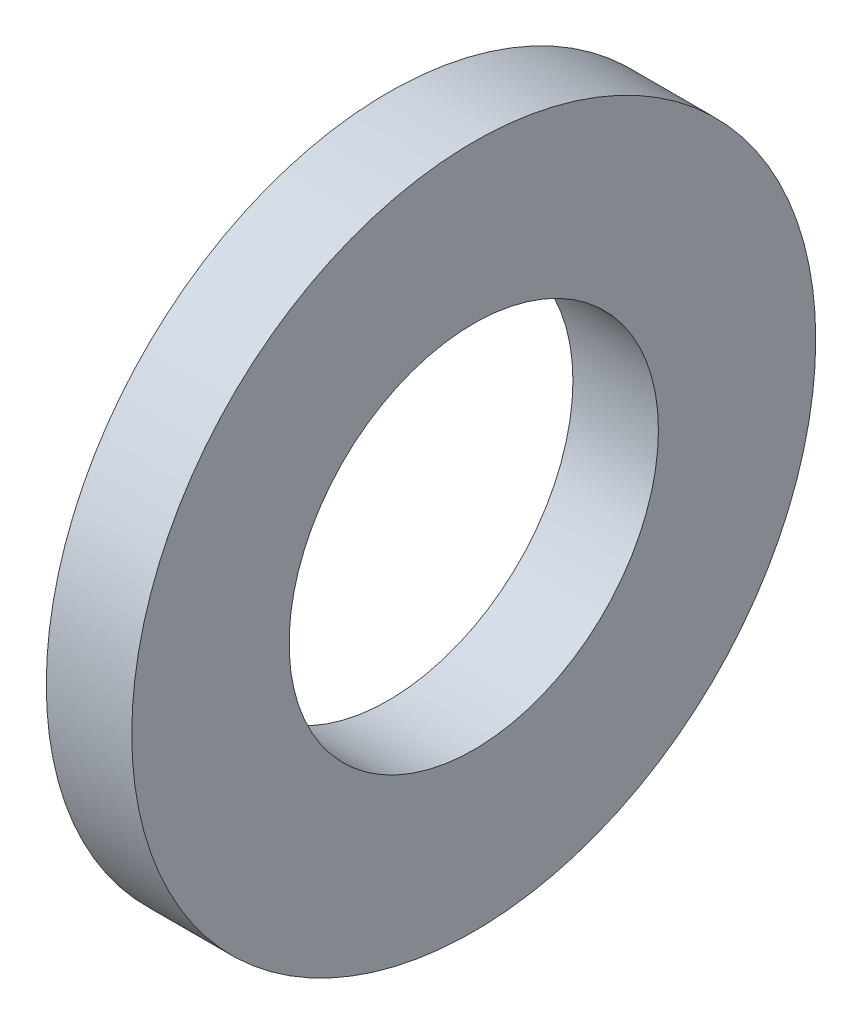
ISO-10303-21;
HEADER;
FILE_DESCRIPTION(('STEP AP214'),'2;1');
FILE_NAME('part.step','',(''),(''),'','','');
FILE_SCHEMA(('AUTOMOTIVE_DESIGN { 1 0 10303 214 1 1 1 1 }'));
ENDSEC;
DATA;
#1=APPLICATION_CONTEXT('core data for automotive mechanical design processes');
#2=APPLICATION_PROTOCOL_DEFINITION('international standard','automotive_design',2000,#1);
#3=PRODUCT_CONTEXT('',#1,'mechanical');
#4=PRODUCT('Part','Part','',(#3));
#5=PRODUCT_RELATED_PRODUCT_CATEGORY('part','',(#4));
#6=PRODUCT_DEFINITION_FORMATION('','',#4);
#7=PRODUCT_DEFINITION_CONTEXT('part definition',#1,'design');
#8=PRODUCT_DEFINITION('design','',#6,#7);
#9=PRODUCT_DEFINITION_SHAPE('','',#8);
#10=(LENGTH_UNIT() NAMED_UNIT(*) SI_UNIT(.MILLI.,.METRE.));
#11=(NAMED_UNIT(*) PLANE_ANGLE_UNIT() SI_UNIT($,.RADIAN.));
#12=(NAMED_UNIT(*) SI_UNIT($,.STERADIAN.) SOLID_ANGLE_UNIT());
#13=UNCERTAINTY_MEASURE_WITH_UNIT(LENGTH_MEASURE(1.E-05),#10,'distance_accuracy_value','');
#14=(GEOMETRIC_REPRESENTATION_CONTEXT(3) GLOBAL_UNCERTAINTY_ASSIGNED_CONTEXT((#13)) GLOBAL_UNIT_ASSIGNED_CONTEXT((#10,
#11,#12)) REPRESENTATION_CONTEXT('',''));
#15=CARTESIAN_POINT('',(0.,0.,0.));
#16=DIRECTION('',(0.,0.,1.));
#17=DIRECTION('',(1.,0.,0.));
#18=AXIS2_PLACEMENT_3D('',#15,#16,#17);
#19=CARTESIAN_POINT('',(-10.678943371,0.,0.));
#20=DIRECTION('',(1.,0.,0.));
#21=DIRECTION('',(0.,0.,-1.));
#22=AXIS2_PLACEMENT_3D('',#19,#20,#21);
#23=CYLINDRICAL_SURFACE('',#22,2.739130435);
#24=CARTESIAN_POINT('',(-9.410827428,0.,0.));
#25=DIRECTION('',(1.,0.,0.));
#26=DIRECTION('',(0.,0.,-1.));
#27=AXIS2_PLACEMENT_3D('',#24,#25,#26);
#28=CIRCLE('',#27,2.739130435);
#29=CARTESIAN_POINT('',(-9.410827428,0.,-2.739130435));
#30=VERTEX_POINT('',#29);
#31=EDGE_CURVE('E18',#30,#30,#28,.F.);
#32=ORIENTED_EDGE('',*,*,#31,.F.);
#33=EDGE_LOOP('',(#32));
#34=FACE_BOUND('',#33,.T.);
#35=CARTESIAN_POINT('',(-10.678943371,0.,0.));
#36=DIRECTION('',(1.,0.,0.));
#37=DIRECTION('',(0.,0.,-1.));
#38=AXIS2_PLACEMENT_3D('',#35,#36,#37);
#39=CIRCLE('',#38,2.739130435);
#40=CARTESIAN_POINT('',(-10.678943371,0.,-2.739130435));
#41=VERTEX_POINT('',#40);
#42=EDGE_CURVE('E30',#41,#41,#39,.T.);
#43=ORIENTED_EDGE('',*,*,#42,.F.);
#44=EDGE_LOOP('',(#43));
#45=FACE_BOUND('',#44,.T.);
#46=ADVANCED_FACE('F14',(#34,#45),#23,.F.);
#47=CARTESIAN_POINT('',(-9.410827428,-5.133333334,5.133333334));
#48=DIRECTION('',(1.,0.,0.));
#49=DIRECTION('',(0.,0.,-1.));
#50=AXIS2_PLACEMENT_3D('',#47,#48,#49);
#51=PLANE('',#50);
#52=ORIENTED_EDGE('',*,*,#31,.T.);
#53=EDGE_LOOP('',(#52));
#54=FACE_BOUND('',#53,.T.);
#55=CARTESIAN_POINT('',(-9.410827428,0.,0.));
#56=DIRECTION('',(1.,0.,0.));
#57=DIRECTION('',(0.,0.,-1.));
#58=AXIS2_PLACEMENT_3D('',#55,#56,#57);
#59=CIRCLE('',#58,5.072463769);
#60=CARTESIAN_POINT('',(-9.410827428,0.,-5.072463769));
#61=VERTEX_POINT('',#60);
#62=EDGE_CURVE('E23',#61,#61,#59,.T.);
#63=ORIENTED_EDGE('',*,*,#62,.T.);
#64=EDGE_LOOP('',(#63));
#65=FACE_BOUND('',#64,.T.);
#66=ADVANCED_FACE('F40',(#54,#65),#51,.T.);
#67=CARTESIAN_POINT('',(-10.678943371,-5.133333334,-5.133333334));
#68=DIRECTION('',(-1.,0.,0.));
#69=DIRECTION('',(0.,0.,1.));
#70=AXIS2_PLACEMENT_3D('',#67,#68,#69);
#71=PLANE('',#70);
#72=ORIENTED_EDGE('',*,*,#42,.T.);
#73=EDGE_LOOP('',(#72));
#74=FACE_BOUND('',#73,.T.);
#75=CARTESIAN_POINT('',(-10.678943371,0.,0.));
#76=DIRECTION('',(1.,0.,0.));
#77=DIRECTION('',(0.,0.,-1.));
#78=AXIS2_PLACEMENT_3D('',#75,#76,#77);
#79=CIRCLE('',#78,5.072463769);
#80=CARTESIAN_POINT('',(-10.678943371,0.,-5.072463769));
#81=VERTEX_POINT('',#80);
#82=EDGE_CURVE('E10',#81,#81,#79,.F.);
#83=ORIENTED_EDGE('',*,*,#82,.T.);
#84=EDGE_LOOP('',(#83));
#85=FACE_BOUND('',#84,.T.);
#86=ADVANCED_FACE('F16',(#74,#85),#71,.T.);
#87=CARTESIAN_POINT('',(-10.678943371,0.,0.));
#88=DIRECTION('',(1.,0.,0.));
#89=DIRECTION('',(0.,0.,-1.));
#90=AXIS2_PLACEMENT_3D('',#87,#88,#89);
#91=CYLINDRICAL_SURFACE('',#90,5.072463769);
#92=ORIENTED_EDGE('',*,*,#82,.F.);
#93=EDGE_LOOP('',(#92));
#94=FACE_BOUND('',#93,.T.);
#95=ORIENTED_EDGE('',*,*,#62,.F.);
#96=EDGE_LOOP('',(#95));
#97=FACE_BOUND('',#96,.T.);
#98=ADVANCED_FACE('F51',(#94,#97),#91,.T.);
#99=CLOSED_SHELL('',(#46,#66,#86,#98));
#100=MANIFOLD_SOLID_BREP('B1',#99);
#101=ADVANCED_BREP_SHAPE_REPRESENTATION('',(#18,#100),#14);
#102=SHAPE_DEFINITION_REPRESENTATION(#9,#101);
ENDSEC;
END-ISO-10303-21;
